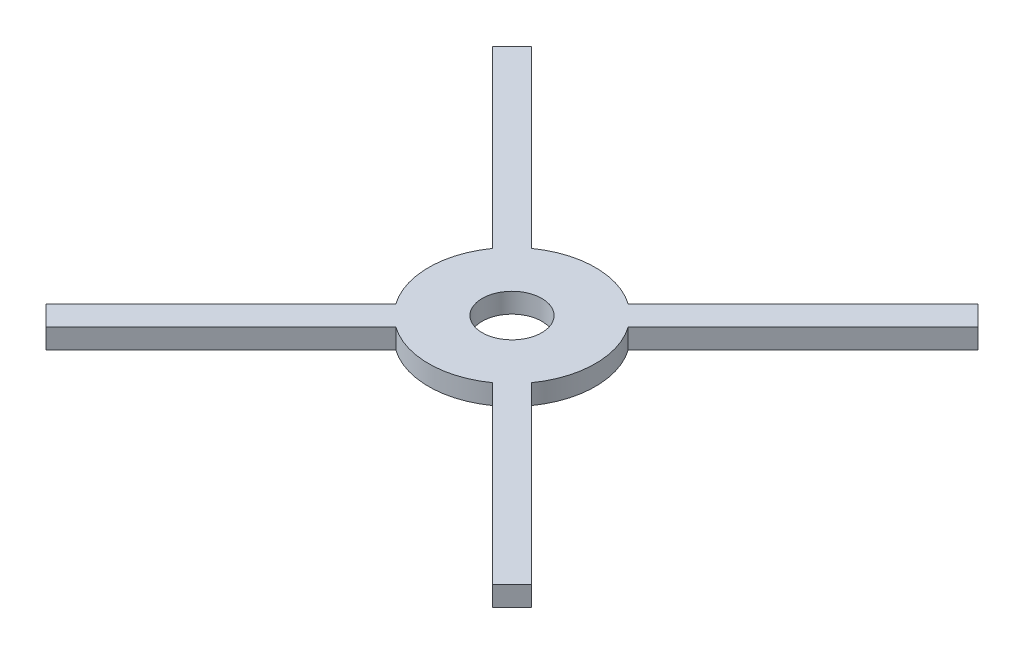
ISO-10303-21;
HEADER;
FILE_DESCRIPTION(('STEP AP214'),'2;1');
FILE_NAME('part.step','',(''),(''),'','','');
FILE_SCHEMA(('AUTOMOTIVE_DESIGN { 1 0 10303 214 1 1 1 1 }'));
ENDSEC;
DATA;
#1=APPLICATION_CONTEXT('core data for automotive mechanical design processes');
#2=APPLICATION_PROTOCOL_DEFINITION('international standard','automotive_design',2000,#1);
#3=PRODUCT_CONTEXT('',#1,'mechanical');
#4=PRODUCT('Part','Part','',(#3));
#5=PRODUCT_RELATED_PRODUCT_CATEGORY('part','',(#4));
#6=PRODUCT_DEFINITION_FORMATION('','',#4);
#7=PRODUCT_DEFINITION_CONTEXT('part definition',#1,'design');
#8=PRODUCT_DEFINITION('design','',#6,#7);
#9=PRODUCT_DEFINITION_SHAPE('','',#8);
#10=(LENGTH_UNIT() NAMED_UNIT(*) SI_UNIT(.MILLI.,.METRE.));
#11=(NAMED_UNIT(*) PLANE_ANGLE_UNIT() SI_UNIT($,.RADIAN.));
#12=(NAMED_UNIT(*) SI_UNIT($,.STERADIAN.) SOLID_ANGLE_UNIT());
#13=UNCERTAINTY_MEASURE_WITH_UNIT(LENGTH_MEASURE(1.E-05),#10,'distance_accuracy_value','');
#14=(GEOMETRIC_REPRESENTATION_CONTEXT(3) GLOBAL_UNCERTAINTY_ASSIGNED_CONTEXT((#13)) GLOBAL_UNIT_ASSIGNED_CONTEXT((#10,
#11,#12)) REPRESENTATION_CONTEXT('',''));
#15=CARTESIAN_POINT('',(0.,0.,0.));
#16=DIRECTION('',(0.,0.,1.));
#17=DIRECTION('',(1.,0.,0.));
#18=AXIS2_PLACEMENT_3D('',#15,#16,#17);
#19=CARTESIAN_POINT('',(0.,5.,0.));
#20=DIRECTION('',(0.,-1.,0.));
#21=DIRECTION('',(0.,0.,-1.));
#22=AXIS2_PLACEMENT_3D('',#19,#20,#21);
#23=CYLINDRICAL_SURFACE('',#22,21.);
#24=CARTESIAN_POINT('',(0.,0.,0.));
#25=DIRECTION('',(0.,1.,0.));
#26=DIRECTION('',(0.,0.,1.));
#27=AXIS2_PLACEMENT_3D('',#24,#25,#26);
#28=CIRCLE('',#27,21.);
#29=CARTESIAN_POINT('',(-17.1164241984992,0.,-12.1666767301934));
#30=VERTEX_POINT('',#29);
#31=CARTESIAN_POINT('',(-17.1164241984992,0.,12.1666767301934));
#32=VERTEX_POINT('',#31);
#33=EDGE_CURVE('E197',#30,#32,#28,.T.);
#34=ORIENTED_EDGE('',*,*,#33,.T.);
#35=DIRECTION('',(0.,-1.,0.));
#36=VECTOR('',#35,1.);
#37=CARTESIAN_POINT('',(-17.1164241984992,5.,12.1666767301934));
#38=LINE('',#37,#36);
#39=CARTESIAN_POINT('',(-17.1164241984992,5.,12.1666767301934));
#40=VERTEX_POINT('',#39);
#41=EDGE_CURVE('E11',#40,#32,#38,.T.);
#42=ORIENTED_EDGE('',*,*,#41,.F.);
#43=CARTESIAN_POINT('',(0.,5.,0.));
#44=DIRECTION('',(0.,1.,0.));
#45=DIRECTION('',(0.,0.,1.));
#46=AXIS2_PLACEMENT_3D('',#43,#44,#45);
#47=CIRCLE('',#46,21.);
#48=CARTESIAN_POINT('',(-17.1164241984992,5.,-12.1666767301934));
#49=VERTEX_POINT('',#48);
#50=EDGE_CURVE('E122',#49,#40,#47,.T.);
#51=ORIENTED_EDGE('',*,*,#50,.F.);
#52=DIRECTION('',(0.,-1.,0.));
#53=VECTOR('',#52,1.);
#54=CARTESIAN_POINT('',(-17.1164241984992,5.,-12.1666767301934));
#55=LINE('',#54,#53);
#56=EDGE_CURVE('E192',#49,#30,#55,.T.);
#57=ORIENTED_EDGE('',*,*,#56,.T.);
#58=EDGE_LOOP('',(#34,#42,#51,#57));
#59=FACE_BOUND('',#58,.T.);
#60=ADVANCED_FACE('F41',(#59),#23,.T.);
#61=CARTESIAN_POINT('',(-2.47487373415293,5.,-2.47487373415293));
#62=DIRECTION('',(-0.707106781186548,0.,-0.707106781186547));
#63=DIRECTION('',(-0.707106781186547,0.,0.707106781186548));
#64=AXIS2_PLACEMENT_3D('',#61,#62,#63);
#65=PLANE('',#64);
#66=DIRECTION('',(0.707106781186547,0.,-0.707106781186548));
#67=VECTOR('',#66,1.);
#68=CARTESIAN_POINT('',(-2.47487373415293,0.,-2.47487373415293));
#69=LINE('',#68,#67);
#70=CARTESIAN_POINT('',(-61.1792420589889,0.,56.2294945906831));
#71=VERTEX_POINT('',#70);
#72=EDGE_CURVE('E201',#71,#32,#69,.T.);
#73=ORIENTED_EDGE('',*,*,#72,.F.);
#74=DIRECTION('',(0.,-1.,0.));
#75=VECTOR('',#74,1.);
#76=CARTESIAN_POINT('',(-61.1792420589889,5.,56.2294945906831));
#77=LINE('',#76,#75);
#78=CARTESIAN_POINT('',(-61.1792420589889,5.,56.2294945906831));
#79=VERTEX_POINT('',#78);
#80=EDGE_CURVE('E51',#79,#71,#77,.T.);
#81=ORIENTED_EDGE('',*,*,#80,.F.);
#82=DIRECTION('',(0.707106781186547,0.,-0.707106781186548));
#83=VECTOR('',#82,1.);
#84=CARTESIAN_POINT('',(-2.47487373415293,5.,-2.47487373415293));
#85=LINE('',#84,#83);
#86=EDGE_CURVE('E307',#79,#40,#85,.T.);
#87=ORIENTED_EDGE('',*,*,#86,.T.);
#88=ORIENTED_EDGE('',*,*,#41,.T.);
#89=EDGE_LOOP('',(#73,#81,#87,#88));
#90=FACE_BOUND('',#89,.T.);
#91=ADVANCED_FACE('F306',(#90),#65,.T.);
#92=CARTESIAN_POINT('',(-58.704368324836,5.,58.704368324836));
#93=DIRECTION('',(0.707106781186548,0.,-0.707106781186548));
#94=DIRECTION('',(-0.707106781186548,0.,-0.707106781186548));
#95=AXIS2_PLACEMENT_3D('',#92,#93,#94);
#96=PLANE('',#95);
#97=DIRECTION('',(0.707106781186548,0.,0.707106781186548));
#98=VECTOR('',#97,1.);
#99=CARTESIAN_POINT('',(-58.704368324836,0.,58.704368324836));
#100=LINE('',#99,#98);
#101=CARTESIAN_POINT('',(-56.2294945906831,0.,61.1792420589889));
#102=VERTEX_POINT('',#101);
#103=EDGE_CURVE('E205',#71,#102,#100,.T.);
#104=ORIENTED_EDGE('',*,*,#103,.T.);
#105=DIRECTION('',(0.,-1.,0.));
#106=VECTOR('',#105,1.);
#107=CARTESIAN_POINT('',(-56.2294945906831,5.,61.1792420589889));
#108=LINE('',#107,#106);
#109=CARTESIAN_POINT('',(-56.2294945906831,5.,61.1792420589889));
#110=VERTEX_POINT('',#109);
#111=EDGE_CURVE('E288',#110,#102,#108,.T.);
#112=ORIENTED_EDGE('',*,*,#111,.F.);
#113=DIRECTION('',(0.707106781186548,0.,0.707106781186548));
#114=VECTOR('',#113,1.);
#115=CARTESIAN_POINT('',(-58.704368324836,5.,58.704368324836));
#116=LINE('',#115,#114);
#117=EDGE_CURVE('E297',#79,#110,#116,.T.);
#118=ORIENTED_EDGE('',*,*,#117,.F.);
#119=ORIENTED_EDGE('',*,*,#80,.T.);
#120=EDGE_LOOP('',(#104,#112,#118,#119));
#121=FACE_BOUND('',#120,.T.);
#122=ADVANCED_FACE('F295',(#121),#96,.F.);
#123=CARTESIAN_POINT('',(2.4748737341529,5.,2.4748737341529));
#124=DIRECTION('',(-0.707106781186548,0.,-0.707106781186547));
#125=DIRECTION('',(-0.707106781186547,0.,0.707106781186548));
#126=AXIS2_PLACEMENT_3D('',#123,#124,#125);
#127=PLANE('',#126);
#128=DIRECTION('',(0.707106781186547,0.,-0.707106781186548));
#129=VECTOR('',#128,1.);
#130=CARTESIAN_POINT('',(2.4748737341529,0.,2.4748737341529));
#131=LINE('',#130,#129);
#132=CARTESIAN_POINT('',(-12.1666767301934,0.,17.1164241984992));
#133=VERTEX_POINT('',#132);
#134=EDGE_CURVE('E208',#102,#133,#131,.T.);
#135=ORIENTED_EDGE('',*,*,#134,.T.);
#136=DIRECTION('',(0.,-1.,0.));
#137=VECTOR('',#136,1.);
#138=CARTESIAN_POINT('',(-12.1666767301934,5.,17.1164241984992));
#139=LINE('',#138,#137);
#140=CARTESIAN_POINT('',(-12.1666767301934,5.,17.1164241984992));
#141=VERTEX_POINT('',#140);
#142=EDGE_CURVE('E284',#141,#133,#139,.T.);
#143=ORIENTED_EDGE('',*,*,#142,.F.);
#144=DIRECTION('',(0.707106781186547,0.,-0.707106781186548));
#145=VECTOR('',#144,1.);
#146=CARTESIAN_POINT('',(2.4748737341529,5.,2.4748737341529));
#147=LINE('',#146,#145);
#148=EDGE_CURVE('E359',#110,#141,#147,.T.);
#149=ORIENTED_EDGE('',*,*,#148,.F.);
#150=ORIENTED_EDGE('',*,*,#111,.T.);
#151=EDGE_LOOP('',(#135,#143,#149,#150));
#152=FACE_BOUND('',#151,.T.);
#153=ADVANCED_FACE('F358',(#152),#127,.F.);
#154=CARTESIAN_POINT('',(0.,5.,0.));
#155=DIRECTION('',(0.,-1.,0.));
#156=DIRECTION('',(0.,0.,-1.));
#157=AXIS2_PLACEMENT_3D('',#154,#155,#156);
#158=CYLINDRICAL_SURFACE('',#157,21.);
#159=CARTESIAN_POINT('',(0.,0.,0.));
#160=DIRECTION('',(0.,1.,0.));
#161=DIRECTION('',(0.,0.,1.));
#162=AXIS2_PLACEMENT_3D('',#159,#160,#161);
#163=CIRCLE('',#162,21.);
#164=CARTESIAN_POINT('',(12.1666767301933,0.,17.1164241984993));
#165=VERTEX_POINT('',#164);
#166=EDGE_CURVE('E211',#133,#165,#163,.T.);
#167=ORIENTED_EDGE('',*,*,#166,.T.);
#168=DIRECTION('',(0.,-1.,0.));
#169=VECTOR('',#168,1.);
#170=CARTESIAN_POINT('',(12.1666767301933,5.,17.1164241984993));
#171=LINE('',#170,#169);
#172=CARTESIAN_POINT('',(12.1666767301933,5.,17.1164241984993));
#173=VERTEX_POINT('',#172);
#174=EDGE_CURVE('E280',#173,#165,#171,.T.);
#175=ORIENTED_EDGE('',*,*,#174,.F.);
#176=CARTESIAN_POINT('',(0.,5.,0.));
#177=DIRECTION('',(0.,1.,0.));
#178=DIRECTION('',(0.,0.,1.));
#179=AXIS2_PLACEMENT_3D('',#176,#177,#178);
#180=CIRCLE('',#179,21.);
#181=EDGE_CURVE('E354',#141,#173,#180,.T.);
#182=ORIENTED_EDGE('',*,*,#181,.F.);
#183=ORIENTED_EDGE('',*,*,#142,.T.);
#184=EDGE_LOOP('',(#167,#175,#182,#183));
#185=FACE_BOUND('',#184,.T.);
#186=ADVANCED_FACE('F353',(#185),#158,.T.);
#187=CARTESIAN_POINT('',(-2.47487373415294,5.,2.47487373415293));
#188=DIRECTION('',(0.707106781186549,0.,-0.707106781186546));
#189=DIRECTION('',(-0.707106781186546,0.,-0.707106781186549));
#190=AXIS2_PLACEMENT_3D('',#187,#188,#189);
#191=PLANE('',#190);
#192=DIRECTION('',(0.707106781186546,0.,0.707106781186549));
#193=VECTOR('',#192,1.);
#194=CARTESIAN_POINT('',(-2.47487373415294,0.,2.47487373415293));
#195=LINE('',#194,#193);
#196=CARTESIAN_POINT('',(56.2294945906829,0.,61.179242058989));
#197=VERTEX_POINT('',#196);
#198=EDGE_CURVE('E214',#165,#197,#195,.T.);
#199=ORIENTED_EDGE('',*,*,#198,.T.);
#200=DIRECTION('',(0.,-1.,0.));
#201=VECTOR('',#200,1.);
#202=CARTESIAN_POINT('',(56.2294945906829,5.,61.179242058989));
#203=LINE('',#202,#201);
#204=CARTESIAN_POINT('',(56.2294945906829,5.,61.179242058989));
#205=VERTEX_POINT('',#204);
#206=EDGE_CURVE('E277',#205,#197,#203,.T.);
#207=ORIENTED_EDGE('',*,*,#206,.F.);
#208=DIRECTION('',(0.707106781186546,0.,0.707106781186549));
#209=VECTOR('',#208,1.);
#210=CARTESIAN_POINT('',(-2.47487373415294,5.,2.47487373415293));
#211=LINE('',#210,#209);
#212=EDGE_CURVE('E350',#173,#205,#211,.T.);
#213=ORIENTED_EDGE('',*,*,#212,.F.);
#214=ORIENTED_EDGE('',*,*,#174,.T.);
#215=EDGE_LOOP('',(#199,#207,#213,#214));
#216=FACE_BOUND('',#215,.T.);
#217=ADVANCED_FACE('F348',(#216),#191,.F.);
#218=CARTESIAN_POINT('',(58.7043683248357,5.,58.7043683248362));
#219=DIRECTION('',(0.707106781186545,0.,0.707106781186551));
#220=DIRECTION('',(0.707106781186551,0.,-0.707106781186545));
#221=AXIS2_PLACEMENT_3D('',#218,#219,#220);
#222=PLANE('',#221);
#223=DIRECTION('',(-0.707106781186551,0.,0.707106781186545));
#224=VECTOR('',#223,1.);
#225=CARTESIAN_POINT('',(58.7043683248357,0.,58.7043683248362));
#226=LINE('',#225,#224);
#227=CARTESIAN_POINT('',(61.1792420589887,0.,56.2294945906832));
#228=VERTEX_POINT('',#227);
#229=EDGE_CURVE('E218',#228,#197,#226,.T.);
#230=ORIENTED_EDGE('',*,*,#229,.F.);
#231=DIRECTION('',(0.,-1.,0.));
#232=VECTOR('',#231,1.);
#233=CARTESIAN_POINT('',(61.1792420589887,5.,56.2294945906832));
#234=LINE('',#233,#232);
#235=CARTESIAN_POINT('',(61.1792420589887,5.,56.2294945906832));
#236=VERTEX_POINT('',#235);
#237=EDGE_CURVE('E274',#236,#228,#234,.T.);
#238=ORIENTED_EDGE('',*,*,#237,.F.);
#239=DIRECTION('',(-0.707106781186551,0.,0.707106781186545));
#240=VECTOR('',#239,1.);
#241=CARTESIAN_POINT('',(58.7043683248357,5.,58.7043683248362));
#242=LINE('',#241,#240);
#243=EDGE_CURVE('E345',#236,#205,#242,.T.);
#244=ORIENTED_EDGE('',*,*,#243,.T.);
#245=ORIENTED_EDGE('',*,*,#206,.T.);
#246=EDGE_LOOP('',(#230,#238,#244,#245));
#247=FACE_BOUND('',#246,.T.);
#248=ADVANCED_FACE('F341',(#247),#222,.T.);
#249=CARTESIAN_POINT('',(2.47487373415294,5.,-2.47487373415293));
#250=DIRECTION('',(0.70710678118655,0.,-0.707106781186545));
#251=DIRECTION('',(-0.707106781186545,0.,-0.70710678118655));
#252=AXIS2_PLACEMENT_3D('',#249,#250,#251);
#253=PLANE('',#252);
#254=DIRECTION('',(0.707106781186545,0.,0.70710678118655));
#255=VECTOR('',#254,1.);
#256=CARTESIAN_POINT('',(2.47487373415294,0.,-2.47487373415293));
#257=LINE('',#256,#255);
#258=CARTESIAN_POINT('',(17.1164241984992,0.,12.1666767301934));
#259=VERTEX_POINT('',#258);
#260=EDGE_CURVE('E222',#259,#228,#257,.T.);
#261=ORIENTED_EDGE('',*,*,#260,.F.);
#262=DIRECTION('',(0.,-1.,0.));
#263=VECTOR('',#262,1.);
#264=CARTESIAN_POINT('',(17.1164241984992,5.,12.1666767301934));
#265=LINE('',#264,#263);
#266=CARTESIAN_POINT('',(17.1164241984992,5.,12.1666767301934));
#267=VERTEX_POINT('',#266);
#268=EDGE_CURVE('E271',#267,#259,#265,.T.);
#269=ORIENTED_EDGE('',*,*,#268,.F.);
#270=DIRECTION('',(0.707106781186545,0.,0.70710678118655));
#271=VECTOR('',#270,1.);
#272=CARTESIAN_POINT('',(2.47487373415294,5.,-2.47487373415293));
#273=LINE('',#272,#271);
#274=EDGE_CURVE('E337',#267,#236,#273,.T.);
#275=ORIENTED_EDGE('',*,*,#274,.T.);
#276=ORIENTED_EDGE('',*,*,#237,.T.);
#277=EDGE_LOOP('',(#261,#269,#275,#276));
#278=FACE_BOUND('',#277,.T.);
#279=ADVANCED_FACE('F336',(#278),#253,.T.);
#280=CARTESIAN_POINT('',(0.,5.,0.));
#281=DIRECTION('',(0.,-1.,0.));
#282=DIRECTION('',(0.,0.,-1.));
#283=AXIS2_PLACEMENT_3D('',#280,#281,#282);
#284=CYLINDRICAL_SURFACE('',#283,21.);
#285=CARTESIAN_POINT('',(0.,0.,0.));
#286=DIRECTION('',(0.,1.,0.));
#287=DIRECTION('',(0.,0.,1.));
#288=AXIS2_PLACEMENT_3D('',#285,#286,#287);
#289=CIRCLE('',#288,21.);
#290=CARTESIAN_POINT('',(17.1164241984992,0.,-12.1666767301934));
#291=VERTEX_POINT('',#290);
#292=EDGE_CURVE('E226',#259,#291,#289,.T.);
#293=ORIENTED_EDGE('',*,*,#292,.T.);
#294=DIRECTION('',(0.,-1.,0.));
#295=VECTOR('',#294,1.);
#296=CARTESIAN_POINT('',(17.1164241984992,5.,-12.1666767301934));
#297=LINE('',#296,#295);
#298=CARTESIAN_POINT('',(17.1164241984992,5.,-12.1666767301934));
#299=VERTEX_POINT('',#298);
#300=EDGE_CURVE('E267',#299,#291,#297,.T.);
#301=ORIENTED_EDGE('',*,*,#300,.F.);
#302=CARTESIAN_POINT('',(0.,5.,0.));
#303=DIRECTION('',(0.,1.,0.));
#304=DIRECTION('',(0.,0.,1.));
#305=AXIS2_PLACEMENT_3D('',#302,#303,#304);
#306=CIRCLE('',#305,21.);
#307=EDGE_CURVE('E332',#267,#299,#306,.T.);
#308=ORIENTED_EDGE('',*,*,#307,.F.);
#309=ORIENTED_EDGE('',*,*,#268,.T.);
#310=EDGE_LOOP('',(#293,#301,#308,#309));
#311=FACE_BOUND('',#310,.T.);
#312=ADVANCED_FACE('F331',(#311),#284,.T.);
#313=CARTESIAN_POINT('',(2.4748737341529,5.,2.4748737341529));
#314=DIRECTION('',(-0.707106781186548,0.,-0.707106781186547));
#315=DIRECTION('',(-0.707106781186547,0.,0.707106781186548));
#316=AXIS2_PLACEMENT_3D('',#313,#314,#315);
#317=PLANE('',#316);
#318=DIRECTION('',(0.707106781186547,0.,-0.707106781186548));
#319=VECTOR('',#318,1.);
#320=CARTESIAN_POINT('',(2.4748737341529,0.,2.4748737341529));
#321=LINE('',#320,#319);
#322=CARTESIAN_POINT('',(61.1792420589889,0.,-56.2294945906831));
#323=VERTEX_POINT('',#322);
#324=EDGE_CURVE('E229',#291,#323,#321,.T.);
#325=ORIENTED_EDGE('',*,*,#324,.T.);
#326=DIRECTION('',(0.,-1.,0.));
#327=VECTOR('',#326,1.);
#328=CARTESIAN_POINT('',(61.1792420589889,5.,-56.2294945906831));
#329=LINE('',#328,#327);
#330=CARTESIAN_POINT('',(61.1792420589889,5.,-56.2294945906831));
#331=VERTEX_POINT('',#330);
#332=EDGE_CURVE('E264',#331,#323,#329,.T.);
#333=ORIENTED_EDGE('',*,*,#332,.F.);
#334=DIRECTION('',(0.707106781186547,0.,-0.707106781186548));
#335=VECTOR('',#334,1.);
#336=CARTESIAN_POINT('',(2.4748737341529,5.,2.4748737341529));
#337=LINE('',#336,#335);
#338=EDGE_CURVE('E328',#299,#331,#337,.T.);
#339=ORIENTED_EDGE('',*,*,#338,.F.);
#340=ORIENTED_EDGE('',*,*,#300,.T.);
#341=EDGE_LOOP('',(#325,#333,#339,#340));
#342=FACE_BOUND('',#341,.T.);
#343=ADVANCED_FACE('F325',(#342),#317,.F.);
#344=CARTESIAN_POINT('',(58.704368324836,5.,-58.704368324836));
#345=DIRECTION('',(0.707106781186548,0.,-0.707106781186548));
#346=DIRECTION('',(-0.707106781186548,0.,-0.707106781186548));
#347=AXIS2_PLACEMENT_3D('',#344,#345,#346);
#348=PLANE('',#347);
#349=DIRECTION('',(0.707106781186548,0.,0.707106781186548));
#350=VECTOR('',#349,1.);
#351=CARTESIAN_POINT('',(58.704368324836,0.,-58.704368324836));
#352=LINE('',#351,#350);
#353=CARTESIAN_POINT('',(56.229494590683,0.,-61.1792420589889));
#354=VERTEX_POINT('',#353);
#355=EDGE_CURVE('E233',#354,#323,#352,.T.);
#356=ORIENTED_EDGE('',*,*,#355,.F.);
#357=DIRECTION('',(0.,-1.,0.));
#358=VECTOR('',#357,1.);
#359=CARTESIAN_POINT('',(56.229494590683,5.,-61.1792420589889));
#360=LINE('',#359,#358);
#361=CARTESIAN_POINT('',(56.229494590683,5.,-61.1792420589889));
#362=VERTEX_POINT('',#361);
#363=EDGE_CURVE('E261',#362,#354,#360,.T.);
#364=ORIENTED_EDGE('',*,*,#363,.F.);
#365=DIRECTION('',(0.707106781186548,0.,0.707106781186548));
#366=VECTOR('',#365,1.);
#367=CARTESIAN_POINT('',(58.704368324836,5.,-58.704368324836));
#368=LINE('',#367,#366);
#369=EDGE_CURVE('E378',#362,#331,#368,.T.);
#370=ORIENTED_EDGE('',*,*,#369,.T.);
#371=ORIENTED_EDGE('',*,*,#332,.T.);
#372=EDGE_LOOP('',(#356,#364,#370,#371));
#373=FACE_BOUND('',#372,.T.);
#374=ADVANCED_FACE('F319',(#373),#348,.T.);
#375=CARTESIAN_POINT('',(-2.47487373415293,5.,-2.47487373415293));
#376=DIRECTION('',(-0.707106781186548,0.,-0.707106781186547));
#377=DIRECTION('',(-0.707106781186547,0.,0.707106781186548));
#378=AXIS2_PLACEMENT_3D('',#375,#376,#377);
#379=PLANE('',#378);
#380=DIRECTION('',(0.707106781186547,0.,-0.707106781186548));
#381=VECTOR('',#380,1.);
#382=CARTESIAN_POINT('',(-2.47487373415293,0.,-2.47487373415293));
#383=LINE('',#382,#381);
#384=CARTESIAN_POINT('',(12.1666767301934,0.,-17.1164241984993));
#385=VERTEX_POINT('',#384);
#386=EDGE_CURVE('E237',#385,#354,#383,.T.);
#387=ORIENTED_EDGE('',*,*,#386,.F.);
#388=DIRECTION('',(0.,-1.,0.));
#389=VECTOR('',#388,1.);
#390=CARTESIAN_POINT('',(12.1666767301934,5.,-17.1164241984993));
#391=LINE('',#390,#389);
#392=CARTESIAN_POINT('',(12.1666767301934,5.,-17.1164241984993));
#393=VERTEX_POINT('',#392);
#394=EDGE_CURVE('E258',#393,#385,#391,.T.);
#395=ORIENTED_EDGE('',*,*,#394,.F.);
#396=DIRECTION('',(0.707106781186547,0.,-0.707106781186548));
#397=VECTOR('',#396,1.);
#398=CARTESIAN_POINT('',(-2.47487373415293,5.,-2.47487373415293));
#399=LINE('',#398,#397);
#400=EDGE_CURVE('E186',#393,#362,#399,.T.);
#401=ORIENTED_EDGE('',*,*,#400,.T.);
#402=ORIENTED_EDGE('',*,*,#363,.T.);
#403=EDGE_LOOP('',(#387,#395,#401,#402));
#404=FACE_BOUND('',#403,.T.);
#405=ADVANCED_FACE('F313',(#404),#379,.T.);
#406=CARTESIAN_POINT('',(0.,5.,0.));
#407=DIRECTION('',(0.,-1.,0.));
#408=DIRECTION('',(0.,0.,-1.));
#409=AXIS2_PLACEMENT_3D('',#406,#407,#408);
#410=CYLINDRICAL_SURFACE('',#409,21.);
#411=CARTESIAN_POINT('',(0.,0.,0.));
#412=DIRECTION('',(0.,1.,0.));
#413=DIRECTION('',(0.,0.,1.));
#414=AXIS2_PLACEMENT_3D('',#411,#412,#413);
#415=CIRCLE('',#414,21.);
#416=CARTESIAN_POINT('',(-12.1666767301933,0.,-17.1164241984993));
#417=VERTEX_POINT('',#416);
#418=EDGE_CURVE('E241',#385,#417,#415,.T.);
#419=ORIENTED_EDGE('',*,*,#418,.T.);
#420=DIRECTION('',(0.,-1.,0.));
#421=VECTOR('',#420,1.);
#422=CARTESIAN_POINT('',(-12.1666767301933,5.,-17.1164241984993));
#423=LINE('',#422,#421);
#424=CARTESIAN_POINT('',(-12.1666767301933,5.,-17.1164241984993));
#425=VERTEX_POINT('',#424);
#426=EDGE_CURVE('E171',#425,#417,#423,.T.);
#427=ORIENTED_EDGE('',*,*,#426,.F.);
#428=CARTESIAN_POINT('',(0.,5.,0.));
#429=DIRECTION('',(0.,1.,0.));
#430=DIRECTION('',(0.,0.,1.));
#431=AXIS2_PLACEMENT_3D('',#428,#429,#430);
#432=CIRCLE('',#431,21.);
#433=EDGE_CURVE('E181',#393,#425,#432,.T.);
#434=ORIENTED_EDGE('',*,*,#433,.F.);
#435=ORIENTED_EDGE('',*,*,#394,.T.);
#436=EDGE_LOOP('',(#419,#427,#434,#435));
#437=FACE_BOUND('',#436,.T.);
#438=ADVANCED_FACE('F427',(#437),#410,.T.);
#439=CARTESIAN_POINT('',(2.47487373415294,5.,-2.47487373415293));
#440=DIRECTION('',(0.70710678118655,0.,-0.707106781186545));
#441=DIRECTION('',(-0.707106781186545,0.,-0.70710678118655));
#442=AXIS2_PLACEMENT_3D('',#439,#440,#441);
#443=PLANE('',#442);
#444=DIRECTION('',(0.707106781186545,0.,0.70710678118655));
#445=VECTOR('',#444,1.);
#446=CARTESIAN_POINT('',(2.47487373415294,0.,-2.47487373415293));
#447=LINE('',#446,#445);
#448=CARTESIAN_POINT('',(-56.2294945906829,0.,-61.1792420589891));
#449=VERTEX_POINT('',#448);
#450=EDGE_CURVE('E169',#449,#417,#447,.T.);
#451=ORIENTED_EDGE('',*,*,#450,.F.);
#452=DIRECTION('',(0.,-1.,0.));
#453=VECTOR('',#452,1.);
#454=CARTESIAN_POINT('',(-56.2294945906829,5.,-61.1792420589891));
#455=LINE('',#454,#453);
#456=CARTESIAN_POINT('',(-56.2294945906829,5.,-61.1792420589891));
#457=VERTEX_POINT('',#456);
#458=EDGE_CURVE('E163',#457,#449,#455,.T.);
#459=ORIENTED_EDGE('',*,*,#458,.F.);
#460=DIRECTION('',(0.707106781186545,0.,0.70710678118655));
#461=VECTOR('',#460,1.);
#462=CARTESIAN_POINT('',(2.47487373415294,5.,-2.47487373415293));
#463=LINE('',#462,#461);
#464=EDGE_CURVE('E167',#457,#425,#463,.T.);
#465=ORIENTED_EDGE('',*,*,#464,.T.);
#466=ORIENTED_EDGE('',*,*,#426,.T.);
#467=EDGE_LOOP('',(#451,#459,#465,#466));
#468=FACE_BOUND('',#467,.T.);
#469=ADVANCED_FACE('F165',(#468),#443,.T.);
#470=CARTESIAN_POINT('',(-58.7043683248357,5.,-58.7043683248362));
#471=DIRECTION('',(0.707106781186545,0.,0.707106781186551));
#472=DIRECTION('',(0.707106781186551,0.,-0.707106781186545));
#473=AXIS2_PLACEMENT_3D('',#470,#471,#472);
#474=PLANE('',#473);
#475=DIRECTION('',(-0.707106781186551,0.,0.707106781186545));
#476=VECTOR('',#475,1.);
#477=CARTESIAN_POINT('',(-58.7043683248357,0.,-58.7043683248362));
#478=LINE('',#477,#476);
#479=CARTESIAN_POINT('',(-61.1792420589888,0.,-56.2294945906832));
#480=VERTEX_POINT('',#479);
#481=EDGE_CURVE('E110',#449,#480,#478,.T.);
#482=ORIENTED_EDGE('',*,*,#481,.T.);
#483=DIRECTION('',(0.,-1.,0.));
#484=VECTOR('',#483,1.);
#485=CARTESIAN_POINT('',(-61.1792420589888,5.,-56.2294945906832));
#486=LINE('',#485,#484);
#487=CARTESIAN_POINT('',(-61.1792420589888,5.,-56.2294945906832));
#488=VERTEX_POINT('',#487);
#489=EDGE_CURVE('E172',#488,#480,#486,.T.);
#490=ORIENTED_EDGE('',*,*,#489,.F.);
#491=DIRECTION('',(-0.707106781186551,0.,0.707106781186545));
#492=VECTOR('',#491,1.);
#493=CARTESIAN_POINT('',(-58.7043683248357,5.,-58.7043683248362));
#494=LINE('',#493,#492);
#495=EDGE_CURVE('E174',#457,#488,#494,.T.);
#496=ORIENTED_EDGE('',*,*,#495,.F.);
#497=ORIENTED_EDGE('',*,*,#458,.T.);
#498=EDGE_LOOP('',(#482,#490,#496,#497));
#499=FACE_BOUND('',#498,.T.);
#500=ADVANCED_FACE('F175',(#499),#474,.F.);
#501=CARTESIAN_POINT('',(0.,5.,0.));
#502=DIRECTION('',(0.,-1.,0.));
#503=DIRECTION('',(0.,0.,-1.));
#504=AXIS2_PLACEMENT_3D('',#501,#502,#503);
#505=CYLINDRICAL_SURFACE('',#504,7.5);
#506=CARTESIAN_POINT('',(0.,5.,0.));
#507=DIRECTION('',(0.,1.,0.));
#508=DIRECTION('',(0.,0.,1.));
#509=AXIS2_PLACEMENT_3D('',#506,#507,#508);
#510=CIRCLE('',#509,7.5);
#511=CARTESIAN_POINT('',(0.,5.,7.5));
#512=VERTEX_POINT('',#511);
#513=EDGE_CURVE('E251',#512,#512,#510,.T.);
#514=ORIENTED_EDGE('',*,*,#513,.T.);
#515=EDGE_LOOP('',(#514));
#516=FACE_BOUND('',#515,.T.);
#517=CARTESIAN_POINT('',(0.,0.,0.));
#518=DIRECTION('',(0.,1.,0.));
#519=DIRECTION('',(0.,0.,1.));
#520=AXIS2_PLACEMENT_3D('',#517,#518,#519);
#521=CIRCLE('',#520,7.5);
#522=CARTESIAN_POINT('',(0.,0.,7.5));
#523=VERTEX_POINT('',#522);
#524=EDGE_CURVE('E193',#523,#523,#521,.T.);
#525=ORIENTED_EDGE('',*,*,#524,.F.);
#526=EDGE_LOOP('',(#525));
#527=FACE_BOUND('',#526,.T.);
#528=ADVANCED_FACE('F43',(#516,#527),#505,.F.);
#529=CARTESIAN_POINT('',(-2.47487373415294,5.,2.47487373415293));
#530=DIRECTION('',(0.707106781186549,0.,-0.707106781186546));
#531=DIRECTION('',(-0.707106781186546,0.,-0.707106781186549));
#532=AXIS2_PLACEMENT_3D('',#529,#530,#531);
#533=PLANE('',#532);
#534=DIRECTION('',(0.707106781186546,0.,0.707106781186549));
#535=VECTOR('',#534,1.);
#536=CARTESIAN_POINT('',(-2.47487373415294,0.,2.47487373415293));
#537=LINE('',#536,#535);
#538=EDGE_CURVE('E116',#480,#30,#537,.T.);
#539=ORIENTED_EDGE('',*,*,#538,.T.);
#540=ORIENTED_EDGE('',*,*,#56,.F.);
#541=DIRECTION('',(0.707106781186546,0.,0.707106781186549));
#542=VECTOR('',#541,1.);
#543=CARTESIAN_POINT('',(-2.47487373415294,5.,2.47487373415293));
#544=LINE('',#543,#542);
#545=EDGE_CURVE('E59',#488,#49,#544,.T.);
#546=ORIENTED_EDGE('',*,*,#545,.F.);
#547=ORIENTED_EDGE('',*,*,#489,.T.);
#548=EDGE_LOOP('',(#539,#540,#546,#547));
#549=FACE_BOUND('',#548,.T.);
#550=ADVANCED_FACE('F392',(#549),#533,.F.);
#551=CARTESIAN_POINT('',(0.,5.,0.));
#552=DIRECTION('',(0.,1.,0.));
#553=DIRECTION('',(0.,0.,1.));
#554=AXIS2_PLACEMENT_3D('',#551,#552,#553);
#555=PLANE('',#554);
#556=ORIENTED_EDGE('',*,*,#513,.F.);
#557=EDGE_LOOP('',(#556));
#558=FACE_BOUND('',#557,.T.);
#559=ORIENTED_EDGE('',*,*,#50,.T.);
#560=ORIENTED_EDGE('',*,*,#86,.F.);
#561=ORIENTED_EDGE('',*,*,#117,.T.);
#562=ORIENTED_EDGE('',*,*,#148,.T.);
#563=ORIENTED_EDGE('',*,*,#181,.T.);
#564=ORIENTED_EDGE('',*,*,#212,.T.);
#565=ORIENTED_EDGE('',*,*,#243,.F.);
#566=ORIENTED_EDGE('',*,*,#274,.F.);
#567=ORIENTED_EDGE('',*,*,#307,.T.);
#568=ORIENTED_EDGE('',*,*,#338,.T.);
#569=ORIENTED_EDGE('',*,*,#369,.F.);
#570=ORIENTED_EDGE('',*,*,#400,.F.);
#571=ORIENTED_EDGE('',*,*,#433,.T.);
#572=ORIENTED_EDGE('',*,*,#464,.F.);
#573=ORIENTED_EDGE('',*,*,#495,.T.);
#574=ORIENTED_EDGE('',*,*,#545,.T.);
#575=EDGE_LOOP('',(#559,#560,#561,#562,#563,#564,#565,#566,#567,#568,#569,#570,#571,#572,#573,#574));
#576=FACE_BOUND('',#575,.T.);
#577=ADVANCED_FACE('F178',(#558,#576),#555,.T.);
#578=CARTESIAN_POINT('',(0.,0.,0.));
#579=DIRECTION('',(0.,1.,0.));
#580=DIRECTION('',(0.,0.,1.));
#581=AXIS2_PLACEMENT_3D('',#578,#579,#580);
#582=PLANE('',#581);
#583=ORIENTED_EDGE('',*,*,#524,.T.);
#584=EDGE_LOOP('',(#583));
#585=FACE_BOUND('',#584,.T.);
#586=ORIENTED_EDGE('',*,*,#33,.F.);
#587=ORIENTED_EDGE('',*,*,#538,.F.);
#588=ORIENTED_EDGE('',*,*,#481,.F.);
#589=ORIENTED_EDGE('',*,*,#450,.T.);
#590=ORIENTED_EDGE('',*,*,#418,.F.);
#591=ORIENTED_EDGE('',*,*,#386,.T.);
#592=ORIENTED_EDGE('',*,*,#355,.T.);
#593=ORIENTED_EDGE('',*,*,#324,.F.);
#594=ORIENTED_EDGE('',*,*,#292,.F.);
#595=ORIENTED_EDGE('',*,*,#260,.T.);
#596=ORIENTED_EDGE('',*,*,#229,.T.);
#597=ORIENTED_EDGE('',*,*,#198,.F.);
#598=ORIENTED_EDGE('',*,*,#166,.F.);
#599=ORIENTED_EDGE('',*,*,#134,.F.);
#600=ORIENTED_EDGE('',*,*,#103,.F.);
#601=ORIENTED_EDGE('',*,*,#72,.T.);
#602=EDGE_LOOP('',(#586,#587,#588,#589,#590,#591,#592,#593,#594,#595,#596,#597,#598,#599,#600,#601));
#603=FACE_BOUND('',#602,.T.);
#604=ADVANCED_FACE('F304',(#585,#603),#582,.F.);
#605=CLOSED_SHELL('',(#60,#91,#122,#153,#186,#217,#248,#279,#312,#343,#374,#405,#438,#469,#500,
#528,#550,#577,#604));
#606=MANIFOLD_SOLID_BREP('B2',#605);
#607=ADVANCED_BREP_SHAPE_REPRESENTATION('',(#18,#606),#14);
#608=SHAPE_DEFINITION_REPRESENTATION(#9,#607);
ENDSEC;
END-ISO-10303-21;
